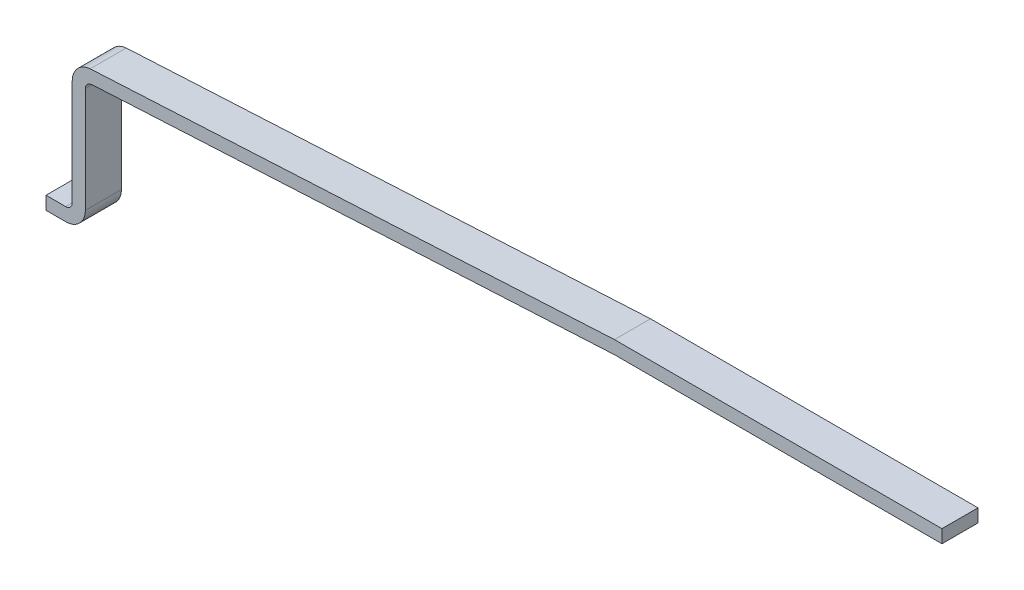
ISO-10303-21;
HEADER;
FILE_DESCRIPTION(('STEP AP214'),'2;1');
FILE_NAME('part.step','',(''),(''),'','','');
FILE_SCHEMA(('AUTOMOTIVE_DESIGN { 1 0 10303 214 1 1 1 1 }'));
ENDSEC;
DATA;
#1=APPLICATION_CONTEXT('core data for automotive mechanical design processes');
#2=APPLICATION_PROTOCOL_DEFINITION('international standard','automotive_design',2000,#1);
#3=PRODUCT_CONTEXT('',#1,'mechanical');
#4=PRODUCT('Part','Part','',(#3));
#5=PRODUCT_RELATED_PRODUCT_CATEGORY('part','',(#4));
#6=PRODUCT_DEFINITION_FORMATION('','',#4);
#7=PRODUCT_DEFINITION_CONTEXT('part definition',#1,'design');
#8=PRODUCT_DEFINITION('design','',#6,#7);
#9=PRODUCT_DEFINITION_SHAPE('','',#8);
#10=(LENGTH_UNIT() NAMED_UNIT(*) SI_UNIT(.MILLI.,.METRE.));
#11=(NAMED_UNIT(*) PLANE_ANGLE_UNIT() SI_UNIT($,.RADIAN.));
#12=(NAMED_UNIT(*) SI_UNIT($,.STERADIAN.) SOLID_ANGLE_UNIT());
#13=UNCERTAINTY_MEASURE_WITH_UNIT(LENGTH_MEASURE(1.E-05),#10,'distance_accuracy_value','');
#14=(GEOMETRIC_REPRESENTATION_CONTEXT(3) GLOBAL_UNCERTAINTY_ASSIGNED_CONTEXT((#13)) GLOBAL_UNIT_ASSIGNED_CONTEXT((#10,
#11,#12)) REPRESENTATION_CONTEXT('',''));
#15=CARTESIAN_POINT('',(0.,0.,0.));
#16=DIRECTION('',(0.,0.,1.));
#17=DIRECTION('',(1.,0.,0.));
#18=AXIS2_PLACEMENT_3D('',#15,#16,#17);
#19=CARTESIAN_POINT('',(-0.0191770545429775,12.2710302640645,0.55));
#20=DIRECTION('',(0.,1.,0.));
#21=DIRECTION('',(-1.,0.,0.));
#22=AXIS2_PLACEMENT_3D('',#19,#20,#21);
#23=PLANE('',#22);
#24=DIRECTION('',(0.,0.,-1.));
#25=VECTOR('',#24,1.);
#26=CARTESIAN_POINT('',(-0.0191770545429774,12.2710302640645,0.55));
#27=LINE('',#26,#25);
#28=CARTESIAN_POINT('',(-0.0191770545429929,12.2710302640645,0.55));
#29=VERTEX_POINT('',#28);
#30=CARTESIAN_POINT('',(-0.0191770545429929,12.2710302640645,0.));
#31=VERTEX_POINT('',#30);
#32=EDGE_CURVE('E255',#29,#31,#27,.T.);
#33=ORIENTED_EDGE('',*,*,#32,.F.);
#34=DIRECTION('',(1.,0.,0.));
#35=VECTOR('',#34,1.);
#36=CARTESIAN_POINT('',(-0.0191770545430678,12.2710302640645,0.55));
#37=LINE('',#36,#35);
#38=CARTESIAN_POINT('',(-0.319177054542932,12.2710302640645,0.55));
#39=VERTEX_POINT('',#38);
#40=EDGE_CURVE('E85',#39,#29,#37,.T.);
#41=ORIENTED_EDGE('',*,*,#40,.F.);
#42=DIRECTION('',(0.,0.,-1.));
#43=VECTOR('',#42,1.);
#44=CARTESIAN_POINT('',(-0.319177054542932,12.2710302640645,0.55));
#45=LINE('',#44,#43);
#46=CARTESIAN_POINT('',(-0.319177054542932,12.2710302640645,0.));
#47=VERTEX_POINT('',#46);
#48=EDGE_CURVE('E94',#39,#47,#45,.T.);
#49=ORIENTED_EDGE('',*,*,#48,.T.);
#50=DIRECTION('',(1.,0.,0.));
#51=VECTOR('',#50,1.);
#52=CARTESIAN_POINT('',(-0.0191770545430678,12.2710302640645,0.));
#53=LINE('',#52,#51);
#54=EDGE_CURVE('E171',#47,#31,#53,.T.);
#55=ORIENTED_EDGE('',*,*,#54,.T.);
#56=EDGE_LOOP('',(#33,#41,#49,#55));
#57=FACE_BOUND('',#56,.T.);
#58=ADVANCED_FACE('F17',(#57),#23,.F.);
#59=CARTESIAN_POINT('',(-0.0191770545430084,12.5710302640645,0.55));
#60=DIRECTION('',(0.,0.,-1.));
#61=DIRECTION('',(-1.,0.,0.));
#62=AXIS2_PLACEMENT_3D('',#59,#60,#61);
#63=CYLINDRICAL_SURFACE('',#62,0.300000000000008);
#64=CARTESIAN_POINT('',(-0.0191770545430084,12.5710302640645,0.55));
#65=DIRECTION('',(0.,0.,-1.));
#66=DIRECTION('',(-1.,0.,0.));
#67=AXIS2_PLACEMENT_3D('',#64,#65,#66);
#68=CIRCLE('',#67,0.300000000000008);
#69=CARTESIAN_POINT('',(0.280822945457,12.5710302640645,0.55));
#70=VERTEX_POINT('',#69);
#71=EDGE_CURVE('E20',#29,#70,#68,.F.);
#72=ORIENTED_EDGE('',*,*,#71,.F.);
#73=ORIENTED_EDGE('',*,*,#32,.T.);
#74=CARTESIAN_POINT('',(-0.0191770545430084,12.5710302640645,0.));
#75=DIRECTION('',(0.,0.,-1.));
#76=DIRECTION('',(-1.,0.,0.));
#77=AXIS2_PLACEMENT_3D('',#74,#75,#76);
#78=CIRCLE('',#77,0.300000000000008);
#79=CARTESIAN_POINT('',(0.280822945457,12.5710302640645,0.));
#80=VERTEX_POINT('',#79);
#81=EDGE_CURVE('E168',#31,#80,#78,.F.);
#82=ORIENTED_EDGE('',*,*,#81,.T.);
#83=DIRECTION('',(0.,0.,1.));
#84=VECTOR('',#83,1.);
#85=CARTESIAN_POINT('',(0.280822945457,12.5710302640645,0.55));
#86=LINE('',#85,#84);
#87=EDGE_CURVE('E252',#80,#70,#86,.T.);
#88=ORIENTED_EDGE('',*,*,#87,.T.);
#89=EDGE_LOOP('',(#72,#73,#82,#88));
#90=FACE_BOUND('',#89,.T.);
#91=ADVANCED_FACE('F437',(#90),#63,.T.);
#92=CARTESIAN_POINT('',(0.280822945456877,14.1793971466627,0.55));
#93=DIRECTION('',(-1.,0.,0.));
#94=DIRECTION('',(0.,-1.,0.));
#95=AXIS2_PLACEMENT_3D('',#92,#93,#94);
#96=PLANE('',#95);
#97=DIRECTION('',(0.,0.,-1.));
#98=VECTOR('',#97,1.);
#99=CARTESIAN_POINT('',(0.280822945456878,14.1793971466627,0.55));
#100=LINE('',#99,#98);
#101=CARTESIAN_POINT('',(0.280822945456939,14.1793971466627,0.));
#102=VERTEX_POINT('',#101);
#103=CARTESIAN_POINT('',(0.280822945456939,14.1793971466627,0.55));
#104=VERTEX_POINT('',#103);
#105=EDGE_CURVE('E250',#102,#104,#100,.F.);
#106=ORIENTED_EDGE('',*,*,#105,.T.);
#107=DIRECTION('',(0.,1.,0.));
#108=VECTOR('',#107,1.);
#109=CARTESIAN_POINT('',(0.280822945457,12.5710302640645,0.55));
#110=LINE('',#109,#108);
#111=EDGE_CURVE('E179',#70,#104,#110,.T.);
#112=ORIENTED_EDGE('',*,*,#111,.F.);
#113=ORIENTED_EDGE('',*,*,#87,.F.);
#114=DIRECTION('',(0.,1.,0.));
#115=VECTOR('',#114,1.);
#116=CARTESIAN_POINT('',(0.280822945457,12.5710302640645,0.));
#117=LINE('',#116,#115);
#118=EDGE_CURVE('E167',#80,#102,#117,.T.);
#119=ORIENTED_EDGE('',*,*,#118,.T.);
#120=EDGE_LOOP('',(#106,#112,#113,#119));
#121=FACE_BOUND('',#120,.T.);
#122=ADVANCED_FACE('F427',(#121),#96,.F.);
#123=CARTESIAN_POINT('',(0.380822945456872,14.1793971466627,0.55));
#124=DIRECTION('',(0.,0.,-1.));
#125=DIRECTION('',(-1.,0.,0.));
#126=AXIS2_PLACEMENT_3D('',#123,#124,#125);
#127=CYLINDRICAL_SURFACE('',#126,0.0999999999999946);
#128=DIRECTION('',(0.,0.,1.));
#129=VECTOR('',#128,1.);
#130=CARTESIAN_POINT('',(0.372107371182212,14.2790166164719,0.55));
#131=LINE('',#130,#129);
#132=CARTESIAN_POINT('',(0.372107371182212,14.2790166164719,0.));
#133=VERTEX_POINT('',#132);
#134=CARTESIAN_POINT('',(0.372107371182212,14.2790166164719,0.55));
#135=VERTEX_POINT('',#134);
#136=EDGE_CURVE('E246',#133,#135,#131,.T.);
#137=ORIENTED_EDGE('',*,*,#136,.T.);
#138=CARTESIAN_POINT('',(0.380822945456872,14.1793971466627,0.55));
#139=DIRECTION('',(0.,0.,-1.));
#140=DIRECTION('',(-1.,0.,0.));
#141=AXIS2_PLACEMENT_3D('',#138,#139,#140);
#142=CIRCLE('',#141,0.0999999999999946);
#143=EDGE_CURVE('E177',#104,#135,#142,.T.);
#144=ORIENTED_EDGE('',*,*,#143,.F.);
#145=ORIENTED_EDGE('',*,*,#105,.F.);
#146=CARTESIAN_POINT('',(0.380822945456872,14.1793971466627,0.));
#147=DIRECTION('',(0.,0.,-1.));
#148=DIRECTION('',(-1.,0.,0.));
#149=AXIS2_PLACEMENT_3D('',#146,#147,#148);
#150=CIRCLE('',#149,0.0999999999999946);
#151=EDGE_CURVE('E163',#102,#133,#150,.T.);
#152=ORIENTED_EDGE('',*,*,#151,.T.);
#153=EDGE_LOOP('',(#137,#144,#145,#152));
#154=FACE_BOUND('',#153,.T.);
#155=ADVANCED_FACE('F417',(#154),#127,.F.);
#156=CARTESIAN_POINT('',(0.432418849359921,14.2850571546016,0.55));
#157=DIRECTION('',(-0.099657105804021,0.995021839590854,0.));
#158=DIRECTION('',(-0.995021839590854,-0.099657105804021,0.));
#159=AXIS2_PLACEMENT_3D('',#156,#157,#158);
#160=PLANE('',#159);
#161=DIRECTION('',(0.,0.,1.));
#162=VECTOR('',#161,1.);
#163=CARTESIAN_POINT('',(0.43241884935992,14.2850571546016,0.55));
#164=LINE('',#163,#162);
#165=CARTESIAN_POINT('',(0.432418849359929,14.2850571546016,0.));
#166=VERTEX_POINT('',#165);
#167=CARTESIAN_POINT('',(0.432418849359929,14.2850571546016,0.55));
#168=VERTEX_POINT('',#167);
#169=EDGE_CURVE('E237',#166,#168,#164,.T.);
#170=ORIENTED_EDGE('',*,*,#169,.T.);
#171=DIRECTION('',(0.995021839590854,0.0996571058040211,0.));
#172=VECTOR('',#171,1.);
#173=CARTESIAN_POINT('',(0.372107371182212,14.2790166164719,0.55));
#174=LINE('',#173,#172);
#175=EDGE_CURVE('E178',#135,#168,#174,.T.);
#176=ORIENTED_EDGE('',*,*,#175,.F.);
#177=ORIENTED_EDGE('',*,*,#136,.F.);
#178=DIRECTION('',(0.995021839590854,0.0996571058040211,0.));
#179=VECTOR('',#178,1.);
#180=CARTESIAN_POINT('',(0.372107371182212,14.2790166164719,0.));
#181=LINE('',#180,#179);
#182=EDGE_CURVE('E166',#133,#166,#181,.T.);
#183=ORIENTED_EDGE('',*,*,#182,.T.);
#184=EDGE_LOOP('',(#170,#176,#177,#183));
#185=FACE_BOUND('',#184,.T.);
#186=ADVANCED_FACE('F408',(#185),#160,.F.);
#187=CARTESIAN_POINT('',(8.35436609429098,14.7,0.55));
#188=DIRECTION('',(-0.0523071907961511,0.99863104187233,0.));
#189=DIRECTION('',(-0.99863104187233,-0.0523071907961511,0.));
#190=AXIS2_PLACEMENT_3D('',#187,#188,#189);
#191=PLANE('',#190);
#192=DIRECTION('',(0.,0.,1.));
#193=VECTOR('',#192,1.);
#194=CARTESIAN_POINT('',(8.35436609429098,14.7,0.55));
#195=LINE('',#194,#193);
#196=CARTESIAN_POINT('',(8.35436609429099,14.7,0.));
#197=VERTEX_POINT('',#196);
#198=CARTESIAN_POINT('',(8.35436609429099,14.7,0.55));
#199=VERTEX_POINT('',#198);
#200=EDGE_CURVE('E227',#197,#199,#195,.T.);
#201=ORIENTED_EDGE('',*,*,#200,.T.);
#202=DIRECTION('',(0.99863104187233,0.0523071907961511,0.));
#203=VECTOR('',#202,1.);
#204=CARTESIAN_POINT('',(0.432418849359921,14.2850571546016,0.55));
#205=LINE('',#204,#203);
#206=EDGE_CURVE('E182',#168,#199,#205,.T.);
#207=ORIENTED_EDGE('',*,*,#206,.F.);
#208=ORIENTED_EDGE('',*,*,#169,.F.);
#209=DIRECTION('',(0.99863104187233,0.0523071907961511,0.));
#210=VECTOR('',#209,1.);
#211=CARTESIAN_POINT('',(0.432418849359921,14.2850571546016,0.));
#212=LINE('',#211,#210);
#213=EDGE_CURVE('E232',#166,#197,#212,.T.);
#214=ORIENTED_EDGE('',*,*,#213,.T.);
#215=EDGE_LOOP('',(#201,#207,#208,#214));
#216=FACE_BOUND('',#215,.T.);
#217=ADVANCED_FACE('F274',(#216),#191,.F.);
#218=CARTESIAN_POINT('',(13.3500000000001,14.6999999999999,0.55));
#219=DIRECTION('',(0.,1.,0.));
#220=DIRECTION('',(-1.,0.,0.));
#221=AXIS2_PLACEMENT_3D('',#218,#219,#220);
#222=PLANE('',#221);
#223=DIRECTION('',(0.,0.,1.));
#224=VECTOR('',#223,1.);
#225=CARTESIAN_POINT('',(13.3500000000001,14.6999999999999,0.55));
#226=LINE('',#225,#224);
#227=CARTESIAN_POINT('',(13.3500000000001,14.7,0.));
#228=VERTEX_POINT('',#227);
#229=CARTESIAN_POINT('',(13.3500000000001,14.7,0.55));
#230=VERTEX_POINT('',#229);
#231=EDGE_CURVE('E216',#228,#230,#226,.T.);
#232=ORIENTED_EDGE('',*,*,#231,.T.);
#233=DIRECTION('',(1.,0.,0.));
#234=VECTOR('',#233,1.);
#235=CARTESIAN_POINT('',(-0.0191770545430678,14.7,0.55));
#236=LINE('',#235,#234);
#237=EDGE_CURVE('E264',#199,#230,#236,.T.);
#238=ORIENTED_EDGE('',*,*,#237,.F.);
#239=ORIENTED_EDGE('',*,*,#200,.F.);
#240=DIRECTION('',(1.,0.,0.));
#241=VECTOR('',#240,1.);
#242=CARTESIAN_POINT('',(-0.0191770545430678,14.7,0.));
#243=LINE('',#242,#241);
#244=EDGE_CURVE('E222',#197,#228,#243,.T.);
#245=ORIENTED_EDGE('',*,*,#244,.T.);
#246=EDGE_LOOP('',(#232,#238,#239,#245));
#247=FACE_BOUND('',#246,.T.);
#248=ADVANCED_FACE('F278',(#247),#222,.F.);
#249=CARTESIAN_POINT('',(13.3500000000001,14.9,0.55));
#250=DIRECTION('',(-1.,0.,0.));
#251=DIRECTION('',(0.,0.,1.));
#252=AXIS2_PLACEMENT_3D('',#249,#250,#251);
#253=PLANE('',#252);
#254=DIRECTION('',(0.,0.,-1.));
#255=VECTOR('',#254,1.);
#256=CARTESIAN_POINT('',(13.3500000000001,14.9,0.55));
#257=LINE('',#256,#255);
#258=CARTESIAN_POINT('',(13.3500000000001,14.9,0.));
#259=VERTEX_POINT('',#258);
#260=CARTESIAN_POINT('',(13.3500000000001,14.9,0.55));
#261=VERTEX_POINT('',#260);
#262=EDGE_CURVE('E211',#259,#261,#257,.F.);
#263=ORIENTED_EDGE('',*,*,#262,.T.);
#264=DIRECTION('',(0.,1.,0.));
#265=VECTOR('',#264,1.);
#266=CARTESIAN_POINT('',(13.3500000000001,12.5710302640645,0.55));
#267=LINE('',#266,#265);
#268=EDGE_CURVE('E197',#230,#261,#267,.T.);
#269=ORIENTED_EDGE('',*,*,#268,.F.);
#270=ORIENTED_EDGE('',*,*,#231,.F.);
#271=DIRECTION('',(0.,1.,0.));
#272=VECTOR('',#271,1.);
#273=CARTESIAN_POINT('',(13.3500000000001,12.5710302640645,0.));
#274=LINE('',#273,#272);
#275=EDGE_CURVE('E219',#228,#259,#274,.T.);
#276=ORIENTED_EDGE('',*,*,#275,.T.);
#277=EDGE_LOOP('',(#263,#269,#270,#276));
#278=FACE_BOUND('',#277,.T.);
#279=ADVANCED_FACE('F282',(#278),#253,.F.);
#280=CARTESIAN_POINT('',(8.35436609429098,14.9,0.55));
#281=DIRECTION('',(0.,-1.,0.));
#282=DIRECTION('',(0.,0.,-1.));
#283=AXIS2_PLACEMENT_3D('',#280,#281,#282);
#284=PLANE('',#283);
#285=DIRECTION('',(0.,0.,-1.));
#286=VECTOR('',#285,1.);
#287=CARTESIAN_POINT('',(8.35436609429098,14.9,0.55));
#288=LINE('',#287,#286);
#289=CARTESIAN_POINT('',(8.35436609429098,14.9,0.55));
#290=VERTEX_POINT('',#289);
#291=CARTESIAN_POINT('',(8.35436609429098,14.9,0.));
#292=VERTEX_POINT('',#291);
#293=EDGE_CURVE('E208',#290,#292,#288,.T.);
#294=ORIENTED_EDGE('',*,*,#293,.F.);
#295=DIRECTION('',(1.,0.,0.));
#296=VECTOR('',#295,1.);
#297=CARTESIAN_POINT('',(-0.0191770545430678,14.9,0.55));
#298=LINE('',#297,#296);
#299=EDGE_CURVE('E194',#261,#290,#298,.F.);
#300=ORIENTED_EDGE('',*,*,#299,.F.);
#301=ORIENTED_EDGE('',*,*,#262,.F.);
#302=DIRECTION('',(1.,0.,0.));
#303=VECTOR('',#302,1.);
#304=CARTESIAN_POINT('',(-0.0191770545430678,14.9,0.));
#305=LINE('',#304,#303);
#306=EDGE_CURVE('E162',#259,#292,#305,.F.);
#307=ORIENTED_EDGE('',*,*,#306,.T.);
#308=EDGE_LOOP('',(#294,#300,#301,#307));
#309=FACE_BOUND('',#308,.T.);
#310=ADVANCED_FACE('F375',(#309),#284,.F.);
#311=CARTESIAN_POINT('',(0.0808229454569316,12.5710302640645,0.55));
#312=DIRECTION('',(1.,0.,0.));
#313=DIRECTION('',(0.,1.,0.));
#314=AXIS2_PLACEMENT_3D('',#311,#312,#313);
#315=PLANE('',#314);
#316=DIRECTION('',(0.,0.,-1.));
#317=VECTOR('',#316,1.);
#318=CARTESIAN_POINT('',(0.0808229454569316,12.5710302640645,0.55));
#319=LINE('',#318,#317);
#320=CARTESIAN_POINT('',(0.0808229454569174,12.5710302640645,0.));
#321=VERTEX_POINT('',#320);
#322=CARTESIAN_POINT('',(0.0808229454569174,12.5710302640645,0.55));
#323=VERTEX_POINT('',#322);
#324=EDGE_CURVE('E131',#321,#323,#319,.F.);
#325=ORIENTED_EDGE('',*,*,#324,.T.);
#326=DIRECTION('',(0.,1.,0.));
#327=VECTOR('',#326,1.);
#328=CARTESIAN_POINT('',(0.0808229454569033,12.5710302640645,0.55));
#329=LINE('',#328,#327);
#330=CARTESIAN_POINT('',(0.0808229454569033,14.1793971466627,0.55));
#331=VERTEX_POINT('',#330);
#332=EDGE_CURVE('E176',#331,#323,#329,.F.);
#333=ORIENTED_EDGE('',*,*,#332,.F.);
#334=DIRECTION('',(0.,0.,-1.));
#335=VECTOR('',#334,1.);
#336=CARTESIAN_POINT('',(0.0808229454569034,14.1793971466627,0.55));
#337=LINE('',#336,#335);
#338=CARTESIAN_POINT('',(0.0808229454569033,14.1793971466627,0.));
#339=VERTEX_POINT('',#338);
#340=EDGE_CURVE('E174',#339,#331,#337,.F.);
#341=ORIENTED_EDGE('',*,*,#340,.F.);
#342=DIRECTION('',(0.,1.,0.));
#343=VECTOR('',#342,1.);
#344=CARTESIAN_POINT('',(0.0808229454569033,12.5710302640645,0.));
#345=LINE('',#344,#343);
#346=EDGE_CURVE('E154',#339,#321,#345,.F.);
#347=ORIENTED_EDGE('',*,*,#346,.T.);
#348=EDGE_LOOP('',(#325,#333,#341,#347));
#349=FACE_BOUND('',#348,.T.);
#350=ADVANCED_FACE('F306',(#349),#315,.F.);
#351=CARTESIAN_POINT('',(-0.0191770545430678,12.5710302640645,0.55));
#352=DIRECTION('',(0.,0.,-1.));
#353=DIRECTION('',(-1.,0.,0.));
#354=AXIS2_PLACEMENT_3D('',#351,#352,#353);
#355=CYLINDRICAL_SURFACE('',#354,0.0999999999999994);
#356=DIRECTION('',(0.,0.,-1.));
#357=VECTOR('',#356,1.);
#358=CARTESIAN_POINT('',(-0.0191770545429775,12.4710302640645,0.55));
#359=LINE('',#358,#357);
#360=CARTESIAN_POINT('',(-0.0191770545430226,12.4710302640645,0.));
#361=VERTEX_POINT('',#360);
#362=CARTESIAN_POINT('',(-0.0191770545430226,12.4710302640645,0.55));
#363=VERTEX_POINT('',#362);
#364=EDGE_CURVE('E138',#361,#363,#359,.F.);
#365=ORIENTED_EDGE('',*,*,#364,.T.);
#366=CARTESIAN_POINT('',(-0.0191770545430678,12.5710302640645,0.55));
#367=DIRECTION('',(0.,0.,-1.));
#368=DIRECTION('',(-1.,0.,0.));
#369=AXIS2_PLACEMENT_3D('',#366,#367,#368);
#370=CIRCLE('',#369,0.0999999999999994);
#371=EDGE_CURVE('E175',#323,#363,#370,.T.);
#372=ORIENTED_EDGE('',*,*,#371,.F.);
#373=ORIENTED_EDGE('',*,*,#324,.F.);
#374=CARTESIAN_POINT('',(-0.0191770545430678,12.5710302640645,0.));
#375=DIRECTION('',(0.,0.,-1.));
#376=DIRECTION('',(-1.,0.,0.));
#377=AXIS2_PLACEMENT_3D('',#374,#375,#376);
#378=CIRCLE('',#377,0.0999999999999994);
#379=EDGE_CURVE('E148',#321,#361,#378,.T.);
#380=ORIENTED_EDGE('',*,*,#379,.T.);
#381=EDGE_LOOP('',(#365,#372,#373,#380));
#382=FACE_BOUND('',#381,.T.);
#383=ADVANCED_FACE('F153',(#382),#355,.F.);
#384=CARTESIAN_POINT('',(-0.319177054542932,12.4710302640645,0.55));
#385=DIRECTION('',(0.,-1.,0.));
#386=DIRECTION('',(0.,0.,-1.));
#387=AXIS2_PLACEMENT_3D('',#384,#385,#386);
#388=PLANE('',#387);
#389=DIRECTION('',(0.,0.,-1.));
#390=VECTOR('',#389,1.);
#391=CARTESIAN_POINT('',(-0.319177054542932,12.4710302640645,0.55));
#392=LINE('',#391,#390);
#393=CARTESIAN_POINT('',(-0.319177054542932,12.4710302640645,0.));
#394=VERTEX_POINT('',#393);
#395=CARTESIAN_POINT('',(-0.319177054542932,12.4710302640645,0.55));
#396=VERTEX_POINT('',#395);
#397=EDGE_CURVE('E144',#394,#396,#392,.F.);
#398=ORIENTED_EDGE('',*,*,#397,.T.);
#399=DIRECTION('',(1.,0.,0.));
#400=VECTOR('',#399,1.);
#401=CARTESIAN_POINT('',(-0.0191770545430678,12.4710302640645,0.55));
#402=LINE('',#401,#400);
#403=EDGE_CURVE('E143',#363,#396,#402,.F.);
#404=ORIENTED_EDGE('',*,*,#403,.F.);
#405=ORIENTED_EDGE('',*,*,#364,.F.);
#406=DIRECTION('',(1.,0.,0.));
#407=VECTOR('',#406,1.);
#408=CARTESIAN_POINT('',(-0.0191770545430678,12.4710302640645,0.));
#409=LINE('',#408,#407);
#410=EDGE_CURVE('E141',#361,#394,#409,.F.);
#411=ORIENTED_EDGE('',*,*,#410,.T.);
#412=EDGE_LOOP('',(#398,#404,#405,#411));
#413=FACE_BOUND('',#412,.T.);
#414=ADVANCED_FACE('F140',(#413),#388,.F.);
#415=CARTESIAN_POINT('',(-0.319177054542932,12.2710302640645,0.55));
#416=DIRECTION('',(1.,0.,0.));
#417=DIRECTION('',(0.,0.,-1.));
#418=AXIS2_PLACEMENT_3D('',#415,#416,#417);
#419=PLANE('',#418);
#420=ORIENTED_EDGE('',*,*,#48,.F.);
#421=DIRECTION('',(0.,1.,0.));
#422=VECTOR('',#421,1.);
#423=CARTESIAN_POINT('',(-0.319177054542932,12.5710302640645,0.55));
#424=LINE('',#423,#422);
#425=EDGE_CURVE('E191',#396,#39,#424,.F.);
#426=ORIENTED_EDGE('',*,*,#425,.F.);
#427=ORIENTED_EDGE('',*,*,#397,.F.);
#428=DIRECTION('',(0.,1.,0.));
#429=VECTOR('',#428,1.);
#430=CARTESIAN_POINT('',(-0.319177054542932,12.5710302640645,0.));
#431=LINE('',#430,#429);
#432=EDGE_CURVE('E151',#394,#47,#431,.F.);
#433=ORIENTED_EDGE('',*,*,#432,.T.);
#434=EDGE_LOOP('',(#420,#426,#427,#433));
#435=FACE_BOUND('',#434,.T.);
#436=ADVANCED_FACE('F317',(#435),#419,.F.);
#437=CARTESIAN_POINT('',(-0.0191770545430678,12.5710302640645,0.55));
#438=DIRECTION('',(0.,0.,1.));
#439=DIRECTION('',(1.,0.,0.));
#440=AXIS2_PLACEMENT_3D('',#437,#438,#439);
#441=PLANE('',#440);
#442=ORIENTED_EDGE('',*,*,#371,.T.);
#443=ORIENTED_EDGE('',*,*,#403,.T.);
#444=ORIENTED_EDGE('',*,*,#425,.T.);
#445=ORIENTED_EDGE('',*,*,#40,.T.);
#446=ORIENTED_EDGE('',*,*,#71,.T.);
#447=ORIENTED_EDGE('',*,*,#111,.T.);
#448=ORIENTED_EDGE('',*,*,#143,.T.);
#449=ORIENTED_EDGE('',*,*,#175,.T.);
#450=ORIENTED_EDGE('',*,*,#206,.T.);
#451=ORIENTED_EDGE('',*,*,#237,.T.);
#452=ORIENTED_EDGE('',*,*,#268,.T.);
#453=ORIENTED_EDGE('',*,*,#299,.T.);
#454=DIRECTION('',(0.998613185792274,0.0526469862556797,0.));
#455=VECTOR('',#454,1.);
#456=CARTESIAN_POINT('',(0.354676222632635,14.4782555560903,0.55));
#457=LINE('',#456,#455);
#458=CARTESIAN_POINT('',(0.354676222632634,14.4782555560903,0.55));
#459=VERTEX_POINT('',#458);
#460=EDGE_CURVE('E201',#290,#459,#457,.F.);
#461=ORIENTED_EDGE('',*,*,#460,.T.);
#462=CARTESIAN_POINT('',(0.380822945456916,14.1793971466627,0.55));
#463=DIRECTION('',(0.,0.,-1.));
#464=DIRECTION('',(-1.,0.,0.));
#465=AXIS2_PLACEMENT_3D('',#462,#463,#464);
#466=CIRCLE('',#465,0.300000000000013);
#467=EDGE_CURVE('E172',#331,#459,#466,.T.);
#468=ORIENTED_EDGE('',*,*,#467,.F.);
#469=ORIENTED_EDGE('',*,*,#332,.T.);
#470=EDGE_LOOP('',(#442,#443,#444,#445,#446,#447,#448,#449,#450,#451,#452,#453,#461,#468,#469));
#471=FACE_BOUND('',#470,.T.);
#472=ADVANCED_FACE('F270',(#471),#441,.T.);
#473=CARTESIAN_POINT('',(0.380822945456916,14.1793971466627,0.55));
#474=DIRECTION('',(0.,0.,-1.));
#475=DIRECTION('',(-1.,0.,0.));
#476=AXIS2_PLACEMENT_3D('',#473,#474,#475);
#477=CYLINDRICAL_SURFACE('',#476,0.300000000000013);
#478=ORIENTED_EDGE('',*,*,#467,.T.);
#479=DIRECTION('',(0.,0.,1.));
#480=VECTOR('',#479,1.);
#481=CARTESIAN_POINT('',(0.354676222632635,14.4782555560903,0.55));
#482=LINE('',#481,#480);
#483=CARTESIAN_POINT('',(0.354676222632634,14.4782555560903,0.));
#484=VERTEX_POINT('',#483);
#485=EDGE_CURVE('E26',#459,#484,#482,.F.);
#486=ORIENTED_EDGE('',*,*,#485,.T.);
#487=CARTESIAN_POINT('',(0.380822945456916,14.1793971466627,0.));
#488=DIRECTION('',(0.,0.,-1.));
#489=DIRECTION('',(-1.,0.,0.));
#490=AXIS2_PLACEMENT_3D('',#487,#488,#489);
#491=CIRCLE('',#490,0.300000000000013);
#492=EDGE_CURVE('E34',#484,#339,#491,.F.);
#493=ORIENTED_EDGE('',*,*,#492,.T.);
#494=ORIENTED_EDGE('',*,*,#340,.T.);
#495=EDGE_LOOP('',(#478,#486,#493,#494));
#496=FACE_BOUND('',#495,.T.);
#497=ADVANCED_FACE('F308',(#496),#477,.T.);
#498=CARTESIAN_POINT('',(-0.0191770545430678,12.5710302640645,0.));
#499=DIRECTION('',(0.,0.,1.));
#500=DIRECTION('',(1.,0.,0.));
#501=AXIS2_PLACEMENT_3D('',#498,#499,#500);
#502=PLANE('',#501);
#503=ORIENTED_EDGE('',*,*,#410,.F.);
#504=ORIENTED_EDGE('',*,*,#379,.F.);
#505=ORIENTED_EDGE('',*,*,#346,.F.);
#506=ORIENTED_EDGE('',*,*,#492,.F.);
#507=DIRECTION('',(0.998613185792274,0.0526469862556797,0.));
#508=VECTOR('',#507,1.);
#509=CARTESIAN_POINT('',(0.354676222632635,14.4782555560903,0.));
#510=LINE('',#509,#508);
#511=EDGE_CURVE('E11',#484,#292,#510,.T.);
#512=ORIENTED_EDGE('',*,*,#511,.T.);
#513=ORIENTED_EDGE('',*,*,#306,.F.);
#514=ORIENTED_EDGE('',*,*,#275,.F.);
#515=ORIENTED_EDGE('',*,*,#244,.F.);
#516=ORIENTED_EDGE('',*,*,#213,.F.);
#517=ORIENTED_EDGE('',*,*,#182,.F.);
#518=ORIENTED_EDGE('',*,*,#151,.F.);
#519=ORIENTED_EDGE('',*,*,#118,.F.);
#520=ORIENTED_EDGE('',*,*,#81,.F.);
#521=ORIENTED_EDGE('',*,*,#54,.F.);
#522=ORIENTED_EDGE('',*,*,#432,.F.);
#523=EDGE_LOOP('',(#503,#504,#505,#506,#512,#513,#514,#515,#516,#517,#518,#519,#520,#521,#522));
#524=FACE_BOUND('',#523,.T.);
#525=ADVANCED_FACE('F147',(#524),#502,.F.);
#526=CARTESIAN_POINT('',(0.354676222632635,14.4782555560903,0.55));
#527=DIRECTION('',(0.0526469862556797,-0.998613185792274,0.));
#528=DIRECTION('',(0.998613185792274,0.0526469862556797,0.));
#529=AXIS2_PLACEMENT_3D('',#526,#527,#528);
#530=PLANE('',#529);
#531=ORIENTED_EDGE('',*,*,#485,.F.);
#532=ORIENTED_EDGE('',*,*,#460,.F.);
#533=ORIENTED_EDGE('',*,*,#293,.T.);
#534=ORIENTED_EDGE('',*,*,#511,.F.);
#535=EDGE_LOOP('',(#531,#532,#533,#534));
#536=FACE_BOUND('',#535,.T.);
#537=ADVANCED_FACE('F290',(#536),#530,.F.);
#538=CLOSED_SHELL('',(#58,#91,#122,#155,#186,#217,#248,#279,#310,#350,#383,#414,#436,#472,#497,
#525,#537));
#539=MANIFOLD_SOLID_BREP('B1',#538);
#540=ADVANCED_BREP_SHAPE_REPRESENTATION('',(#18,#539),#14);
#541=SHAPE_DEFINITION_REPRESENTATION(#9,#540);
ENDSEC;
END-ISO-10303-21;
